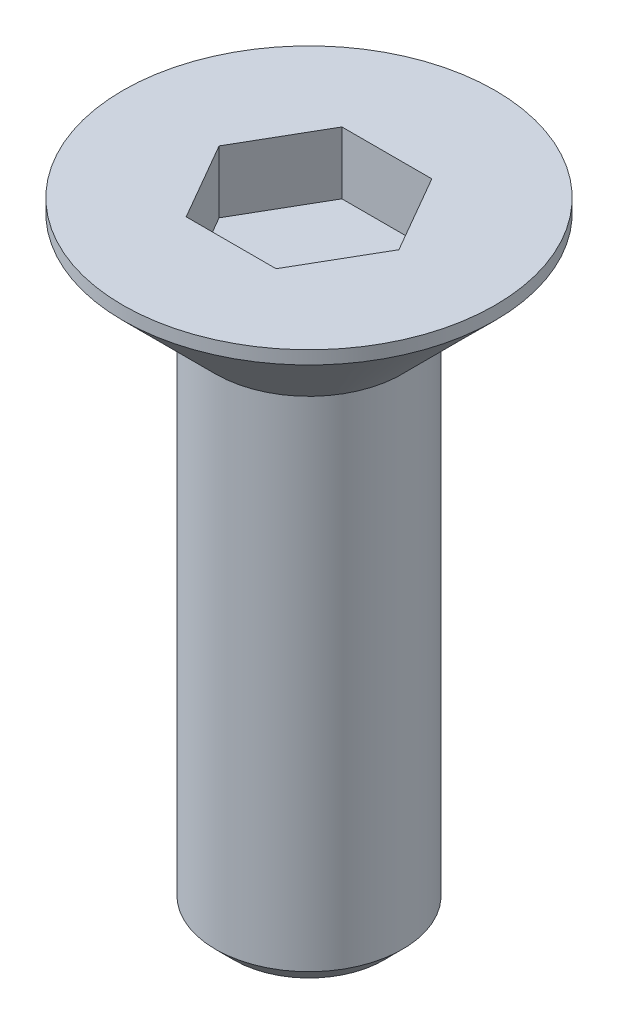
ISO-10303-21;
HEADER;
FILE_DESCRIPTION(('STEP AP214'),'2;1');
FILE_NAME('part.step','',(''),(''),'','','');
FILE_SCHEMA(('AUTOMOTIVE_DESIGN { 1 0 10303 214 1 1 1 1 }'));
ENDSEC;
DATA;
#1=APPLICATION_CONTEXT('core data for automotive mechanical design processes');
#2=APPLICATION_PROTOCOL_DEFINITION('international standard','automotive_design',2000,#1);
#3=PRODUCT_CONTEXT('',#1,'mechanical');
#4=PRODUCT('Part','Part','',(#3));
#5=PRODUCT_RELATED_PRODUCT_CATEGORY('part','',(#4));
#6=PRODUCT_DEFINITION_FORMATION('','',#4);
#7=PRODUCT_DEFINITION_CONTEXT('part definition',#1,'design');
#8=PRODUCT_DEFINITION('design','',#6,#7);
#9=PRODUCT_DEFINITION_SHAPE('','',#8);
#10=(LENGTH_UNIT() NAMED_UNIT(*) SI_UNIT(.MILLI.,.METRE.));
#11=(NAMED_UNIT(*) PLANE_ANGLE_UNIT() SI_UNIT($,.RADIAN.));
#12=(NAMED_UNIT(*) SI_UNIT($,.STERADIAN.) SOLID_ANGLE_UNIT());
#13=UNCERTAINTY_MEASURE_WITH_UNIT(LENGTH_MEASURE(1.E-05),#10,'distance_accuracy_value','');
#14=(GEOMETRIC_REPRESENTATION_CONTEXT(3) GLOBAL_UNCERTAINTY_ASSIGNED_CONTEXT((#13)) GLOBAL_UNIT_ASSIGNED_CONTEXT((#10,
#11,#12)) REPRESENTATION_CONTEXT('',''));
#15=CARTESIAN_POINT('',(0.,0.,0.));
#16=DIRECTION('',(0.,0.,1.));
#17=DIRECTION('',(1.,0.,0.));
#18=AXIS2_PLACEMENT_3D('',#15,#16,#17);
#19=CARTESIAN_POINT('',(0.,0.,0.));
#20=DIRECTION('',(0.,-1.,0.));
#21=DIRECTION('',(0.,0.,-1.));
#22=AXIS2_PLACEMENT_3D('',#19,#20,#21);
#23=PLANE('',#22);
#24=DIRECTION('',(-0.5,0.,0.866025403784439));
#25=VECTOR('',#24,1.);
#26=CARTESIAN_POINT('',(-0.721687836487032,0.,-1.25));
#27=LINE('',#26,#25);
#28=CARTESIAN_POINT('',(-0.721687836487032,0.,-1.25));
#29=VERTEX_POINT('',#28);
#30=CARTESIAN_POINT('',(-1.44337567297406,0.,0.));
#31=VERTEX_POINT('',#30);
#32=EDGE_CURVE('E123',#29,#31,#27,.T.);
#33=ORIENTED_EDGE('',*,*,#32,.F.);
#34=DIRECTION('',(-1.,0.,0.));
#35=VECTOR('',#34,1.);
#36=CARTESIAN_POINT('',(0.721687836487033,0.,-1.25));
#37=LINE('',#36,#35);
#38=CARTESIAN_POINT('',(0.721687836487033,0.,-1.25));
#39=VERTEX_POINT('',#38);
#40=EDGE_CURVE('E49',#39,#29,#37,.T.);
#41=ORIENTED_EDGE('',*,*,#40,.F.);
#42=DIRECTION('',(-0.5,0.,-0.866025403784439));
#43=VECTOR('',#42,1.);
#44=CARTESIAN_POINT('',(1.44337567297406,0.,0.));
#45=LINE('',#44,#43);
#46=CARTESIAN_POINT('',(1.44337567297406,0.,0.));
#47=VERTEX_POINT('',#46);
#48=EDGE_CURVE('E132',#47,#39,#45,.T.);
#49=ORIENTED_EDGE('',*,*,#48,.F.);
#50=DIRECTION('',(0.5,0.,-0.866025403784438));
#51=VECTOR('',#50,1.);
#52=CARTESIAN_POINT('',(0.721687836487032,0.,1.25));
#53=LINE('',#52,#51);
#54=CARTESIAN_POINT('',(0.721687836487032,0.,1.25));
#55=VERTEX_POINT('',#54);
#56=EDGE_CURVE('E130',#55,#47,#53,.T.);
#57=ORIENTED_EDGE('',*,*,#56,.F.);
#58=DIRECTION('',(1.,0.,0.));
#59=VECTOR('',#58,1.);
#60=CARTESIAN_POINT('',(-0.721687836487033,0.,1.25));
#61=LINE('',#60,#59);
#62=CARTESIAN_POINT('',(-0.721687836487033,0.,1.25));
#63=VERTEX_POINT('',#62);
#64=EDGE_CURVE('E97',#63,#55,#61,.T.);
#65=ORIENTED_EDGE('',*,*,#64,.F.);
#66=DIRECTION('',(0.5,0.,0.866025403784439));
#67=VECTOR('',#66,1.);
#68=CARTESIAN_POINT('',(-1.44337567297406,0.,0.));
#69=LINE('',#68,#67);
#70=EDGE_CURVE('E126',#31,#63,#69,.T.);
#71=ORIENTED_EDGE('',*,*,#70,.F.);
#72=EDGE_LOOP('',(#33,#41,#49,#57,#65,#71));
#73=FACE_BOUND('',#72,.T.);
#74=CARTESIAN_POINT('',(0.,0.,0.));
#75=DIRECTION('',(0.,-1.,0.));
#76=DIRECTION('',(0.,0.,-1.));
#77=AXIS2_PLACEMENT_3D('',#74,#75,#76);
#78=CIRCLE('',#77,2.98786796564402);
#79=CARTESIAN_POINT('',(0.,0.,-2.98786796564402));
#80=VERTEX_POINT('',#79);
#81=EDGE_CURVE('E144',#80,#80,#78,.F.);
#82=ORIENTED_EDGE('',*,*,#81,.T.);
#83=EDGE_LOOP('',(#82));
#84=FACE_BOUND('',#83,.T.);
#85=ADVANCED_FACE('F34',(#73,#84),#23,.F.);
#86=CARTESIAN_POINT('',(0.,-1.7,0.));
#87=DIRECTION('',(0.,1.,0.));
#88=DIRECTION('',(0.,0.,1.));
#89=AXIS2_PLACEMENT_3D('',#86,#87,#88);
#90=CONICAL_SURFACE('',#89,1.5,0.785398163397443);
#91=CARTESIAN_POINT('',(0.,-0.212132034355965,0.));
#92=DIRECTION('',(0.,-1.,0.));
#93=DIRECTION('',(0.,0.,-1.));
#94=AXIS2_PLACEMENT_3D('',#91,#92,#93);
#95=CIRCLE('',#94,2.98786796564402);
#96=CARTESIAN_POINT('',(0.,-0.212132034355965,-2.98786796564402));
#97=VERTEX_POINT('',#96);
#98=EDGE_CURVE('E147',#97,#97,#95,.T.);
#99=ORIENTED_EDGE('',*,*,#98,.T.);
#100=EDGE_LOOP('',(#99));
#101=FACE_BOUND('',#100,.T.);
#102=CARTESIAN_POINT('',(0.,-1.7,0.));
#103=DIRECTION('',(0.,1.,0.));
#104=DIRECTION('',(0.,0.,1.));
#105=AXIS2_PLACEMENT_3D('',#102,#103,#104);
#106=CIRCLE('',#105,1.5);
#107=CARTESIAN_POINT('',(0.,-1.7,1.5));
#108=VERTEX_POINT('',#107);
#109=EDGE_CURVE('E136',#108,#108,#106,.T.);
#110=ORIENTED_EDGE('',*,*,#109,.T.);
#111=EDGE_LOOP('',(#110));
#112=FACE_BOUND('',#111,.T.);
#113=ADVANCED_FACE('F169',(#101,#112),#90,.T.);
#114=CARTESIAN_POINT('',(0.,0.,0.));
#115=DIRECTION('',(0.,1.,0.));
#116=DIRECTION('',(0.,0.,1.));
#117=AXIS2_PLACEMENT_3D('',#114,#115,#116);
#118=CYLINDRICAL_SURFACE('',#117,1.5);
#119=CARTESIAN_POINT('',(0.,-9.7,0.));
#120=DIRECTION('',(0.,1.,0.));
#121=DIRECTION('',(0.,0.,1.));
#122=AXIS2_PLACEMENT_3D('',#119,#120,#121);
#123=CIRCLE('',#122,1.5);
#124=CARTESIAN_POINT('',(0.,-9.7,1.5));
#125=VERTEX_POINT('',#124);
#126=EDGE_CURVE('E42',#125,#125,#123,.T.);
#127=ORIENTED_EDGE('',*,*,#126,.T.);
#128=EDGE_LOOP('',(#127));
#129=FACE_BOUND('',#128,.T.);
#130=ORIENTED_EDGE('',*,*,#109,.F.);
#131=EDGE_LOOP('',(#130));
#132=FACE_BOUND('',#131,.T.);
#133=ADVANCED_FACE('F152',(#129,#132),#118,.T.);
#134=CARTESIAN_POINT('',(1.5,-10.,0.));
#135=DIRECTION('',(0.,1.,0.));
#136=DIRECTION('',(0.,0.,1.));
#137=AXIS2_PLACEMENT_3D('',#134,#135,#136);
#138=PLANE('',#137);
#139=CARTESIAN_POINT('',(0.,-10.,0.));
#140=DIRECTION('',(0.,1.,0.));
#141=DIRECTION('',(0.,0.,1.));
#142=AXIS2_PLACEMENT_3D('',#139,#140,#141);
#143=CIRCLE('',#142,1.2);
#144=CARTESIAN_POINT('',(0.,-10.,1.2));
#145=VERTEX_POINT('',#144);
#146=EDGE_CURVE('E11',#145,#145,#143,.F.);
#147=ORIENTED_EDGE('',*,*,#146,.T.);
#148=EDGE_LOOP('',(#147));
#149=FACE_BOUND('',#148,.T.);
#150=ADVANCED_FACE('F165',(#149),#138,.F.);
#151=CARTESIAN_POINT('',(0.,0.,0.));
#152=DIRECTION('',(0.,-1.,0.));
#153=DIRECTION('',(0.,0.,-1.));
#154=AXIS2_PLACEMENT_3D('',#151,#152,#153);
#155=CYLINDRICAL_SURFACE('',#154,2.98786796564402);
#156=ORIENTED_EDGE('',*,*,#98,.F.);
#157=EDGE_LOOP('',(#156));
#158=FACE_BOUND('',#157,.T.);
#159=ORIENTED_EDGE('',*,*,#81,.F.);
#160=EDGE_LOOP('',(#159));
#161=FACE_BOUND('',#160,.T.);
#162=ADVANCED_FACE('F157',(#158,#161),#155,.T.);
#163=CARTESIAN_POINT('',(0.,-9.7,0.));
#164=DIRECTION('',(0.,1.,0.));
#165=DIRECTION('',(0.,0.,1.));
#166=AXIS2_PLACEMENT_3D('',#163,#164,#165);
#167=CONICAL_SURFACE('',#166,1.5,0.78539816339745);
#168=ORIENTED_EDGE('',*,*,#146,.F.);
#169=EDGE_LOOP('',(#168));
#170=FACE_BOUND('',#169,.T.);
#171=ORIENTED_EDGE('',*,*,#126,.F.);
#172=EDGE_LOOP('',(#171));
#173=FACE_BOUND('',#172,.T.);
#174=ADVANCED_FACE('F36',(#170,#173),#167,.T.);
#175=CARTESIAN_POINT('',(0.721687836487033,-1.,-1.25));
#176=DIRECTION('',(0.,0.,-1.));
#177=DIRECTION('',(-1.,0.,0.));
#178=AXIS2_PLACEMENT_3D('',#175,#176,#177);
#179=PLANE('',#178);
#180=ORIENTED_EDGE('',*,*,#40,.T.);
#181=DIRECTION('',(0.,1.,0.));
#182=VECTOR('',#181,1.);
#183=CARTESIAN_POINT('',(-0.721687836487032,-1.,-1.25));
#184=LINE('',#183,#182);
#185=CARTESIAN_POINT('',(-0.721687836487032,-1.,-1.25));
#186=VERTEX_POINT('',#185);
#187=EDGE_CURVE('E79',#186,#29,#184,.T.);
#188=ORIENTED_EDGE('',*,*,#187,.F.);
#189=DIRECTION('',(-1.,0.,0.));
#190=VECTOR('',#189,1.);
#191=CARTESIAN_POINT('',(0.721687836487033,-1.,-1.25));
#192=LINE('',#191,#190);
#193=CARTESIAN_POINT('',(0.721687836487033,-1.,-1.25));
#194=VERTEX_POINT('',#193);
#195=EDGE_CURVE('E134',#194,#186,#192,.T.);
#196=ORIENTED_EDGE('',*,*,#195,.F.);
#197=DIRECTION('',(0.,1.,0.));
#198=VECTOR('',#197,1.);
#199=CARTESIAN_POINT('',(0.721687836487033,-1.,-1.25));
#200=LINE('',#199,#198);
#201=EDGE_CURVE('E57',#194,#39,#200,.T.);
#202=ORIENTED_EDGE('',*,*,#201,.T.);
#203=EDGE_LOOP('',(#180,#188,#196,#202));
#204=FACE_BOUND('',#203,.T.);
#205=ADVANCED_FACE('F156',(#204),#179,.F.);
#206=CARTESIAN_POINT('',(1.44337567297406,-1.,0.));
#207=DIRECTION('',(0.866025403784439,0.,-0.5));
#208=DIRECTION('',(-0.5,0.,-0.866025403784439));
#209=AXIS2_PLACEMENT_3D('',#206,#207,#208);
#210=PLANE('',#209);
#211=ORIENTED_EDGE('',*,*,#48,.T.);
#212=ORIENTED_EDGE('',*,*,#201,.F.);
#213=DIRECTION('',(-0.5,0.,-0.866025403784439));
#214=VECTOR('',#213,1.);
#215=CARTESIAN_POINT('',(1.44337567297406,-1.,0.));
#216=LINE('',#215,#214);
#217=CARTESIAN_POINT('',(1.44337567297406,-1.,0.));
#218=VERTEX_POINT('',#217);
#219=EDGE_CURVE('E109',#218,#194,#216,.T.);
#220=ORIENTED_EDGE('',*,*,#219,.F.);
#221=DIRECTION('',(0.,1.,0.));
#222=VECTOR('',#221,1.);
#223=CARTESIAN_POINT('',(1.44337567297406,-1.,0.));
#224=LINE('',#223,#222);
#225=EDGE_CURVE('E101',#218,#47,#224,.T.);
#226=ORIENTED_EDGE('',*,*,#225,.T.);
#227=EDGE_LOOP('',(#211,#212,#220,#226));
#228=FACE_BOUND('',#227,.T.);
#229=ADVANCED_FACE('F163',(#228),#210,.F.);
#230=CARTESIAN_POINT('',(0.721687836487032,-1.,1.25));
#231=DIRECTION('',(0.866025403784439,0.,0.5));
#232=DIRECTION('',(0.5,0.,-0.866025403784438));
#233=AXIS2_PLACEMENT_3D('',#230,#231,#232);
#234=PLANE('',#233);
#235=ORIENTED_EDGE('',*,*,#56,.T.);
#236=ORIENTED_EDGE('',*,*,#225,.F.);
#237=DIRECTION('',(0.5,0.,-0.866025403784438));
#238=VECTOR('',#237,1.);
#239=CARTESIAN_POINT('',(0.721687836487032,-1.,1.25));
#240=LINE('',#239,#238);
#241=CARTESIAN_POINT('',(0.721687836487032,-1.,1.25));
#242=VERTEX_POINT('',#241);
#243=EDGE_CURVE('E105',#242,#218,#240,.T.);
#244=ORIENTED_EDGE('',*,*,#243,.F.);
#245=DIRECTION('',(0.,1.,0.));
#246=VECTOR('',#245,1.);
#247=CARTESIAN_POINT('',(0.721687836487032,-1.,1.25));
#248=LINE('',#247,#246);
#249=EDGE_CURVE('E90',#242,#55,#248,.T.);
#250=ORIENTED_EDGE('',*,*,#249,.T.);
#251=EDGE_LOOP('',(#235,#236,#244,#250));
#252=FACE_BOUND('',#251,.T.);
#253=ADVANCED_FACE('F106',(#252),#234,.F.);
#254=CARTESIAN_POINT('',(-0.721687836487033,-1.,1.25));
#255=DIRECTION('',(0.,0.,1.));
#256=DIRECTION('',(1.,0.,0.));
#257=AXIS2_PLACEMENT_3D('',#254,#255,#256);
#258=PLANE('',#257);
#259=ORIENTED_EDGE('',*,*,#64,.T.);
#260=ORIENTED_EDGE('',*,*,#249,.F.);
#261=DIRECTION('',(1.,0.,0.));
#262=VECTOR('',#261,1.);
#263=CARTESIAN_POINT('',(-0.721687836487033,-1.,1.25));
#264=LINE('',#263,#262);
#265=CARTESIAN_POINT('',(-0.721687836487033,-1.,1.25));
#266=VERTEX_POINT('',#265);
#267=EDGE_CURVE('E94',#266,#242,#264,.T.);
#268=ORIENTED_EDGE('',*,*,#267,.F.);
#269=DIRECTION('',(0.,1.,0.));
#270=VECTOR('',#269,1.);
#271=CARTESIAN_POINT('',(-0.721687836487033,-1.,1.25));
#272=LINE('',#271,#270);
#273=EDGE_CURVE('E102',#266,#63,#272,.T.);
#274=ORIENTED_EDGE('',*,*,#273,.T.);
#275=EDGE_LOOP('',(#259,#260,#268,#274));
#276=FACE_BOUND('',#275,.T.);
#277=ADVANCED_FACE('F92',(#276),#258,.F.);
#278=CARTESIAN_POINT('',(-1.44337567297406,-1.,0.));
#279=DIRECTION('',(-0.866025403784439,0.,0.5));
#280=DIRECTION('',(0.5,0.,0.866025403784439));
#281=AXIS2_PLACEMENT_3D('',#278,#279,#280);
#282=PLANE('',#281);
#283=ORIENTED_EDGE('',*,*,#70,.T.);
#284=ORIENTED_EDGE('',*,*,#273,.F.);
#285=DIRECTION('',(0.5,0.,0.866025403784439));
#286=VECTOR('',#285,1.);
#287=CARTESIAN_POINT('',(-1.44337567297406,-1.,0.));
#288=LINE('',#287,#286);
#289=CARTESIAN_POINT('',(-1.44337567297406,-1.,0.));
#290=VERTEX_POINT('',#289);
#291=EDGE_CURVE('E115',#290,#266,#288,.T.);
#292=ORIENTED_EDGE('',*,*,#291,.F.);
#293=DIRECTION('',(0.,1.,0.));
#294=VECTOR('',#293,1.);
#295=CARTESIAN_POINT('',(-1.44337567297406,-1.,0.));
#296=LINE('',#295,#294);
#297=EDGE_CURVE('E139',#290,#31,#296,.T.);
#298=ORIENTED_EDGE('',*,*,#297,.T.);
#299=EDGE_LOOP('',(#283,#284,#292,#298));
#300=FACE_BOUND('',#299,.T.);
#301=ADVANCED_FACE('F188',(#300),#282,.F.);
#302=CARTESIAN_POINT('',(-0.721687836487032,-1.,-1.25));
#303=DIRECTION('',(-0.866025403784439,0.,-0.5));
#304=DIRECTION('',(-0.5,0.,0.866025403784439));
#305=AXIS2_PLACEMENT_3D('',#302,#303,#304);
#306=PLANE('',#305);
#307=ORIENTED_EDGE('',*,*,#32,.T.);
#308=ORIENTED_EDGE('',*,*,#297,.F.);
#309=DIRECTION('',(-0.5,0.,0.866025403784439));
#310=VECTOR('',#309,1.);
#311=CARTESIAN_POINT('',(-0.721687836487032,-1.,-1.25));
#312=LINE('',#311,#310);
#313=EDGE_CURVE('E117',#186,#290,#312,.T.);
#314=ORIENTED_EDGE('',*,*,#313,.F.);
#315=ORIENTED_EDGE('',*,*,#187,.T.);
#316=EDGE_LOOP('',(#307,#308,#314,#315));
#317=FACE_BOUND('',#316,.T.);
#318=ADVANCED_FACE('F185',(#317),#306,.F.);
#319=CARTESIAN_POINT('',(-0.721687836487032,-1.,-1.25));
#320=DIRECTION('',(0.,1.,0.));
#321=DIRECTION('',(0.,0.,1.));
#322=AXIS2_PLACEMENT_3D('',#319,#320,#321);
#323=PLANE('',#322);
#324=ORIENTED_EDGE('',*,*,#195,.T.);
#325=ORIENTED_EDGE('',*,*,#313,.T.);
#326=ORIENTED_EDGE('',*,*,#291,.T.);
#327=ORIENTED_EDGE('',*,*,#267,.T.);
#328=ORIENTED_EDGE('',*,*,#243,.T.);
#329=ORIENTED_EDGE('',*,*,#219,.T.);
#330=EDGE_LOOP('',(#324,#325,#326,#327,#328,#329));
#331=FACE_BOUND('',#330,.T.);
#332=ADVANCED_FACE('F112',(#331),#323,.T.);
#333=CLOSED_SHELL('',(#85,#113,#133,#150,#162,#174,#205,#229,#253,#277,#301,#318,#332));
#334=MANIFOLD_SOLID_BREP('B2',#333);
#335=ADVANCED_BREP_SHAPE_REPRESENTATION('',(#18,#334),#14);
#336=SHAPE_DEFINITION_REPRESENTATION(#9,#335);
ENDSEC;
END-ISO-10303-21;
